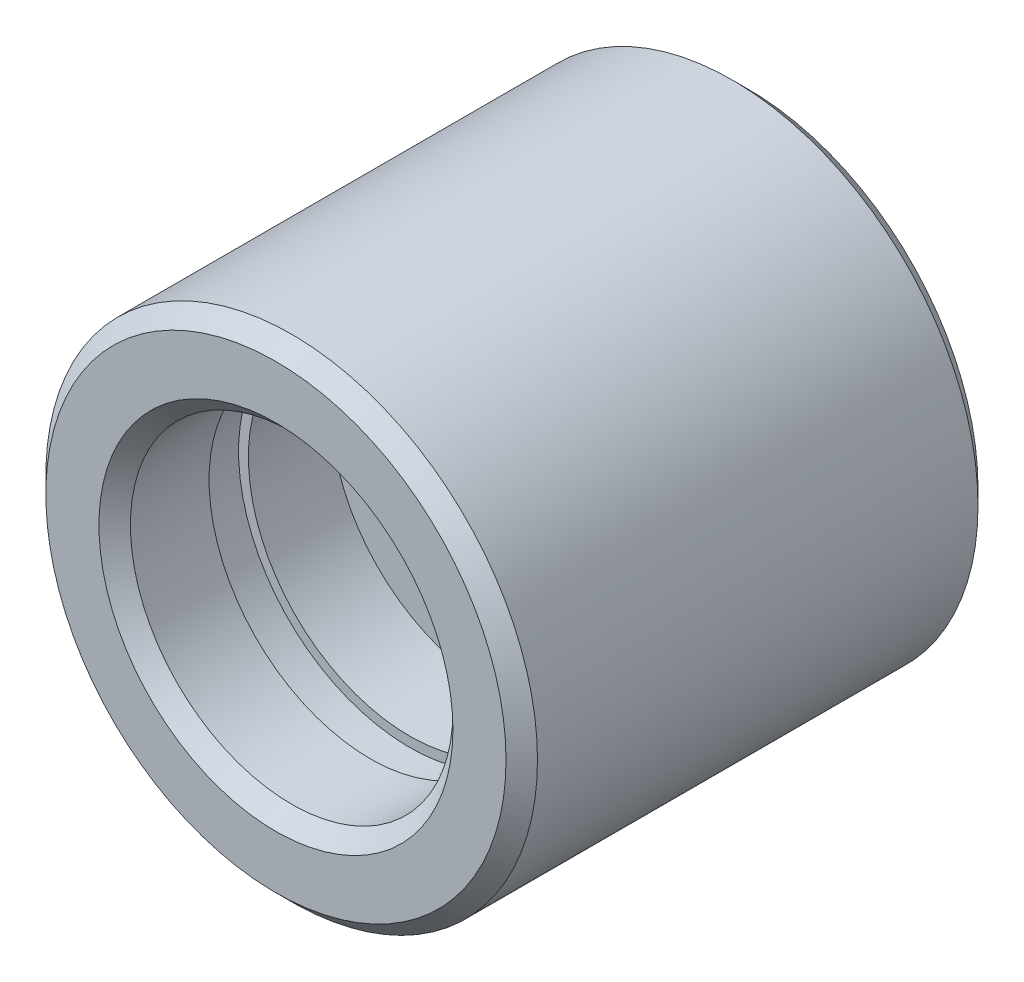
ISO-10303-21;
HEADER;
FILE_DESCRIPTION(('STEP AP214'),'2;1');
FILE_NAME('part.step','',(''),(''),'','','');
FILE_SCHEMA(('AUTOMOTIVE_DESIGN { 1 0 10303 214 1 1 1 1 }'));
ENDSEC;
DATA;
#1=APPLICATION_CONTEXT('core data for automotive mechanical design processes');
#2=APPLICATION_PROTOCOL_DEFINITION('international standard','automotive_design',2000,#1);
#3=PRODUCT_CONTEXT('',#1,'mechanical');
#4=PRODUCT('Part','Part','',(#3));
#5=PRODUCT_RELATED_PRODUCT_CATEGORY('part','',(#4));
#6=PRODUCT_DEFINITION_FORMATION('','',#4);
#7=PRODUCT_DEFINITION_CONTEXT('part definition',#1,'design');
#8=PRODUCT_DEFINITION('design','',#6,#7);
#9=PRODUCT_DEFINITION_SHAPE('','',#8);
#10=(LENGTH_UNIT() NAMED_UNIT(*) SI_UNIT(.MILLI.,.METRE.));
#11=(NAMED_UNIT(*) PLANE_ANGLE_UNIT() SI_UNIT($,.RADIAN.));
#12=(NAMED_UNIT(*) SI_UNIT($,.STERADIAN.) SOLID_ANGLE_UNIT());
#13=UNCERTAINTY_MEASURE_WITH_UNIT(LENGTH_MEASURE(1.E-05),#10,'distance_accuracy_value','');
#14=(GEOMETRIC_REPRESENTATION_CONTEXT(3) GLOBAL_UNCERTAINTY_ASSIGNED_CONTEXT((#13)) GLOBAL_UNIT_ASSIGNED_CONTEXT((#10,
#11,#12)) REPRESENTATION_CONTEXT('',''));
#15=CARTESIAN_POINT('',(0.,0.,0.));
#16=DIRECTION('',(0.,0.,1.));
#17=DIRECTION('',(1.,0.,0.));
#18=AXIS2_PLACEMENT_3D('',#15,#16,#17);
#19=CARTESIAN_POINT('',(0.,1.5,5.9));
#20=DIRECTION('',(0.,-1.,0.));
#21=DIRECTION('',(0.,0.,-1.));
#22=AXIS2_PLACEMENT_3D('',#19,#20,#21);
#23=PLANE('',#22);
#24=DIRECTION('',(-1.,0.,0.));
#25=VECTOR('',#24,1.);
#26=CARTESIAN_POINT('',(0.,1.5,5.9));
#27=LINE('',#26,#25);
#28=CARTESIAN_POINT('',(0.,1.5,5.9));
#29=VERTEX_POINT('',#28);
#30=CARTESIAN_POINT('',(-1.5,1.5,5.9));
#31=VERTEX_POINT('',#30);
#32=EDGE_CURVE('E394',#29,#31,#27,.T.);
#33=ORIENTED_EDGE('',*,*,#32,.T.);
#34=DIRECTION('',(0.,0.,1.));
#35=VECTOR('',#34,1.);
#36=CARTESIAN_POINT('',(-1.5,1.5,5.7));
#37=LINE('',#36,#35);
#38=CARTESIAN_POINT('',(-1.5,1.5,5.7));
#39=VERTEX_POINT('',#38);
#40=EDGE_CURVE('E79',#39,#31,#37,.T.);
#41=ORIENTED_EDGE('',*,*,#40,.F.);
#42=DIRECTION('',(1.,0.,0.));
#43=VECTOR('',#42,1.);
#44=CARTESIAN_POINT('',(0.,1.5,5.7));
#45=LINE('',#44,#43);
#46=CARTESIAN_POINT('',(-3.81575680566778,1.5,5.7));
#47=VERTEX_POINT('',#46);
#48=EDGE_CURVE('E161',#47,#39,#45,.T.);
#49=ORIENTED_EDGE('',*,*,#48,.F.);
#50=DIRECTION('',(0.,0.,-1.));
#51=VECTOR('',#50,1.);
#52=CARTESIAN_POINT('',(-3.81575680566778,1.5,5.9));
#53=LINE('',#52,#51);
#54=CARTESIAN_POINT('',(-3.81575680566778,1.5,5.5));
#55=VERTEX_POINT('',#54);
#56=EDGE_CURVE('E160',#47,#55,#53,.T.);
#57=ORIENTED_EDGE('',*,*,#56,.T.);
#58=DIRECTION('',(-1.,0.,0.));
#59=VECTOR('',#58,1.);
#60=CARTESIAN_POINT('',(0.,1.5,5.5));
#61=LINE('',#60,#59);
#62=CARTESIAN_POINT('',(3.81575680566778,1.5,5.5));
#63=VERTEX_POINT('',#62);
#64=EDGE_CURVE('E169',#63,#55,#61,.T.);
#65=ORIENTED_EDGE('',*,*,#64,.F.);
#66=DIRECTION('',(0.,0.,-1.));
#67=VECTOR('',#66,1.);
#68=CARTESIAN_POINT('',(3.81575680566778,1.5,5.9));
#69=LINE('',#68,#67);
#70=CARTESIAN_POINT('',(3.81575680566778,1.5,5.7));
#71=VERTEX_POINT('',#70);
#72=EDGE_CURVE('E185',#71,#63,#69,.T.);
#73=ORIENTED_EDGE('',*,*,#72,.F.);
#74=DIRECTION('',(1.,0.,0.));
#75=VECTOR('',#74,1.);
#76=CARTESIAN_POINT('',(0.,1.5,5.7));
#77=LINE('',#76,#75);
#78=CARTESIAN_POINT('',(1.5,1.5,5.7));
#79=VERTEX_POINT('',#78);
#80=EDGE_CURVE('E414',#79,#71,#77,.T.);
#81=ORIENTED_EDGE('',*,*,#80,.F.);
#82=DIRECTION('',(0.,0.,1.));
#83=VECTOR('',#82,1.);
#84=CARTESIAN_POINT('',(1.5,1.5,5.7));
#85=LINE('',#84,#83);
#86=CARTESIAN_POINT('',(1.5,1.5,5.9));
#87=VERTEX_POINT('',#86);
#88=EDGE_CURVE('E397',#79,#87,#85,.T.);
#89=ORIENTED_EDGE('',*,*,#88,.T.);
#90=DIRECTION('',(-1.,0.,0.));
#91=VECTOR('',#90,1.);
#92=CARTESIAN_POINT('',(0.,1.5,5.9));
#93=LINE('',#92,#91);
#94=EDGE_CURVE('E175',#87,#29,#93,.T.);
#95=ORIENTED_EDGE('',*,*,#94,.T.);
#96=EDGE_LOOP('',(#33,#41,#49,#57,#65,#73,#81,#89,#95));
#97=FACE_BOUND('',#96,.T.);
#98=ADVANCED_FACE('F63',(#97),#23,.T.);
#99=CARTESIAN_POINT('',(0.,-1.5,5.9));
#100=DIRECTION('',(0.,-1.,0.));
#101=DIRECTION('',(0.,0.,-1.));
#102=AXIS2_PLACEMENT_3D('',#99,#100,#101);
#103=PLANE('',#102);
#104=DIRECTION('',(0.,0.,1.));
#105=VECTOR('',#104,1.);
#106=CARTESIAN_POINT('',(-1.5,-1.5,5.7));
#107=LINE('',#106,#105);
#108=CARTESIAN_POINT('',(-1.5,-1.5,5.7));
#109=VERTEX_POINT('',#108);
#110=CARTESIAN_POINT('',(-1.5,-1.5,5.9));
#111=VERTEX_POINT('',#110);
#112=EDGE_CURVE('E421',#109,#111,#107,.T.);
#113=ORIENTED_EDGE('',*,*,#112,.T.);
#114=DIRECTION('',(-1.,0.,0.));
#115=VECTOR('',#114,1.);
#116=CARTESIAN_POINT('',(0.,-1.5,5.9));
#117=LINE('',#116,#115);
#118=CARTESIAN_POINT('',(0.,-1.5,5.9));
#119=VERTEX_POINT('',#118);
#120=EDGE_CURVE('E167',#119,#111,#117,.T.);
#121=ORIENTED_EDGE('',*,*,#120,.F.);
#122=DIRECTION('',(-1.,0.,0.));
#123=VECTOR('',#122,1.);
#124=CARTESIAN_POINT('',(0.,-1.5,5.9));
#125=LINE('',#124,#123);
#126=CARTESIAN_POINT('',(1.5,-1.5,5.9));
#127=VERTEX_POINT('',#126);
#128=EDGE_CURVE('E178',#127,#119,#125,.T.);
#129=ORIENTED_EDGE('',*,*,#128,.F.);
#130=DIRECTION('',(0.,0.,1.));
#131=VECTOR('',#130,1.);
#132=CARTESIAN_POINT('',(1.5,-1.5,5.7));
#133=LINE('',#132,#131);
#134=CARTESIAN_POINT('',(1.5,-1.5,5.7));
#135=VERTEX_POINT('',#134);
#136=EDGE_CURVE('E87',#135,#127,#133,.T.);
#137=ORIENTED_EDGE('',*,*,#136,.F.);
#138=DIRECTION('',(-1.,0.,0.));
#139=VECTOR('',#138,1.);
#140=CARTESIAN_POINT('',(0.,-1.5,5.7));
#141=LINE('',#140,#139);
#142=CARTESIAN_POINT('',(3.81575680566778,-1.5,5.7));
#143=VERTEX_POINT('',#142);
#144=EDGE_CURVE('E412',#143,#135,#141,.T.);
#145=ORIENTED_EDGE('',*,*,#144,.F.);
#146=DIRECTION('',(0.,0.,-1.));
#147=VECTOR('',#146,1.);
#148=CARTESIAN_POINT('',(3.81575680566778,-1.5,5.9));
#149=LINE('',#148,#147);
#150=CARTESIAN_POINT('',(3.81575680566778,-1.5,5.5));
#151=VERTEX_POINT('',#150);
#152=EDGE_CURVE('E189',#143,#151,#149,.T.);
#153=ORIENTED_EDGE('',*,*,#152,.T.);
#154=DIRECTION('',(-1.,0.,0.));
#155=VECTOR('',#154,1.);
#156=CARTESIAN_POINT('',(0.,-1.5,5.5));
#157=LINE('',#156,#155);
#158=CARTESIAN_POINT('',(-3.81575680566778,-1.5,5.5));
#159=VERTEX_POINT('',#158);
#160=EDGE_CURVE('E165',#151,#159,#157,.T.);
#161=ORIENTED_EDGE('',*,*,#160,.T.);
#162=DIRECTION('',(0.,0.,-1.));
#163=VECTOR('',#162,1.);
#164=CARTESIAN_POINT('',(-3.81575680566778,-1.5,5.9));
#165=LINE('',#164,#163);
#166=CARTESIAN_POINT('',(-3.81575680566778,-1.5,5.7));
#167=VERTEX_POINT('',#166);
#168=EDGE_CURVE('E157',#167,#159,#165,.T.);
#169=ORIENTED_EDGE('',*,*,#168,.F.);
#170=DIRECTION('',(-1.,0.,0.));
#171=VECTOR('',#170,1.);
#172=CARTESIAN_POINT('',(0.,-1.5,5.7));
#173=LINE('',#172,#171);
#174=EDGE_CURVE('E141',#109,#167,#173,.T.);
#175=ORIENTED_EDGE('',*,*,#174,.F.);
#176=EDGE_LOOP('',(#113,#121,#129,#137,#145,#153,#161,#169,#175));
#177=FACE_BOUND('',#176,.T.);
#178=ADVANCED_FACE('F163',(#177),#103,.F.);
#179=CARTESIAN_POINT('',(0.,0.,5.9));
#180=DIRECTION('',(0.,0.,-1.));
#181=DIRECTION('',(-1.,0.,0.));
#182=AXIS2_PLACEMENT_3D('',#179,#180,#181);
#183=PLANE('',#182);
#184=ORIENTED_EDGE('',*,*,#120,.T.);
#185=DIRECTION('',(0.,1.,0.));
#186=VECTOR('',#185,1.);
#187=CARTESIAN_POINT('',(-1.5,0.,5.9));
#188=LINE('',#187,#186);
#189=CARTESIAN_POINT('',(-1.5,0.,5.9));
#190=VERTEX_POINT('',#189);
#191=EDGE_CURVE('E228',#111,#190,#188,.T.);
#192=ORIENTED_EDGE('',*,*,#191,.T.);
#193=CARTESIAN_POINT('',(0.,0.,5.9));
#194=DIRECTION('',(0.,0.,-1.));
#195=DIRECTION('',(-1.,0.,0.));
#196=AXIS2_PLACEMENT_3D('',#193,#194,#195);
#197=CIRCLE('',#196,1.5);
#198=EDGE_CURVE('E400',#190,#119,#197,.F.);
#199=ORIENTED_EDGE('',*,*,#198,.T.);
#200=EDGE_LOOP('',(#184,#192,#199));
#201=FACE_BOUND('',#200,.T.);
#202=ADVANCED_FACE('F282',(#201),#183,.T.);
#203=EDGE_CURVE('E172',#29,#190,#197,.F.);
#204=ORIENTED_EDGE('',*,*,#203,.T.);
#205=DIRECTION('',(0.,-1.,0.));
#206=VECTOR('',#205,1.);
#207=CARTESIAN_POINT('',(-1.5,0.,5.9));
#208=LINE('',#207,#206);
#209=EDGE_CURVE('E151',#31,#190,#208,.T.);
#210=ORIENTED_EDGE('',*,*,#209,.F.);
#211=ORIENTED_EDGE('',*,*,#32,.F.);
#212=EDGE_LOOP('',(#204,#210,#211));
#213=FACE_BOUND('',#212,.T.);
#214=ADVANCED_FACE('F379',(#213),#183,.T.);
#215=CARTESIAN_POINT('',(0.,0.,5.9));
#216=DIRECTION('',(0.,0.,-1.));
#217=DIRECTION('',(-1.,0.,0.));
#218=AXIS2_PLACEMENT_3D('',#215,#216,#217);
#219=PLANE('',#218);
#220=ORIENTED_EDGE('',*,*,#94,.F.);
#221=DIRECTION('',(0.,-1.,0.));
#222=VECTOR('',#221,1.);
#223=CARTESIAN_POINT('',(1.5,0.,5.9));
#224=LINE('',#223,#222);
#225=CARTESIAN_POINT('',(1.5,0.,5.9));
#226=VERTEX_POINT('',#225);
#227=EDGE_CURVE('E225',#87,#226,#224,.T.);
#228=ORIENTED_EDGE('',*,*,#227,.T.);
#229=CARTESIAN_POINT('',(0.,0.,5.9));
#230=DIRECTION('',(0.,0.,-1.));
#231=DIRECTION('',(-1.,0.,0.));
#232=AXIS2_PLACEMENT_3D('',#229,#230,#231);
#233=CIRCLE('',#232,1.5);
#234=EDGE_CURVE('E181',#226,#29,#233,.F.);
#235=ORIENTED_EDGE('',*,*,#234,.T.);
#236=EDGE_LOOP('',(#220,#228,#235));
#237=FACE_BOUND('',#236,.T.);
#238=ADVANCED_FACE('F381',(#237),#219,.T.);
#239=EDGE_CURVE('E182',#119,#226,#233,.F.);
#240=ORIENTED_EDGE('',*,*,#239,.T.);
#241=DIRECTION('',(0.,1.,0.));
#242=VECTOR('',#241,1.);
#243=CARTESIAN_POINT('',(1.5,0.,5.9));
#244=LINE('',#243,#242);
#245=EDGE_CURVE('E410',#127,#226,#244,.T.);
#246=ORIENTED_EDGE('',*,*,#245,.F.);
#247=ORIENTED_EDGE('',*,*,#128,.T.);
#248=EDGE_LOOP('',(#240,#246,#247));
#249=FACE_BOUND('',#248,.T.);
#250=ADVANCED_FACE('F327',(#249),#219,.T.);
#251=CARTESIAN_POINT('',(0.,0.,-0.000999999999999265));
#252=DIRECTION('',(0.,0.,1.));
#253=DIRECTION('',(1.,0.,0.));
#254=AXIS2_PLACEMENT_3D('',#251,#252,#253);
#255=CYLINDRICAL_SURFACE('',#254,1.5);
#256=CARTESIAN_POINT('',(0.,0.,6.5));
#257=DIRECTION('',(0.,0.,1.));
#258=DIRECTION('',(1.,0.,0.));
#259=AXIS2_PLACEMENT_3D('',#256,#257,#258);
#260=CIRCLE('',#259,1.5);
#261=CARTESIAN_POINT('',(1.5,0.,6.5));
#262=VERTEX_POINT('',#261);
#263=EDGE_CURVE('E222',#262,#262,#260,.F.);
#264=ORIENTED_EDGE('',*,*,#263,.F.);
#265=EDGE_LOOP('',(#264));
#266=FACE_BOUND('',#265,.T.);
#267=ORIENTED_EDGE('',*,*,#203,.F.);
#268=ORIENTED_EDGE('',*,*,#234,.F.);
#269=ORIENTED_EDGE('',*,*,#239,.F.);
#270=ORIENTED_EDGE('',*,*,#198,.F.);
#271=EDGE_LOOP('',(#267,#268,#269,#270));
#272=FACE_BOUND('',#271,.T.);
#273=ADVANCED_FACE('F324',(#266,#272),#255,.F.);
#274=CARTESIAN_POINT('',(0.,0.,5.5));
#275=DIRECTION('',(0.,0.,-1.));
#276=DIRECTION('',(-1.,0.,0.));
#277=AXIS2_PLACEMENT_3D('',#274,#275,#276);
#278=PLANE('',#277);
#279=ORIENTED_EDGE('',*,*,#64,.T.);
#280=CARTESIAN_POINT('',(0.,0.,5.5));
#281=DIRECTION('',(0.,0.,-1.));
#282=DIRECTION('',(-1.,0.,0.));
#283=AXIS2_PLACEMENT_3D('',#280,#281,#282);
#284=CIRCLE('',#283,4.1);
#285=EDGE_CURVE('E206',#55,#63,#284,.T.);
#286=ORIENTED_EDGE('',*,*,#285,.T.);
#287=EDGE_LOOP('',(#279,#286));
#288=FACE_BOUND('',#287,.T.);
#289=ADVANCED_FACE('F315',(#288),#278,.T.);
#290=EDGE_CURVE('E217',#151,#159,#284,.T.);
#291=ORIENTED_EDGE('',*,*,#290,.T.);
#292=ORIENTED_EDGE('',*,*,#160,.F.);
#293=EDGE_LOOP('',(#291,#292));
#294=FACE_BOUND('',#293,.T.);
#295=ADVANCED_FACE('F312',(#294),#278,.T.);
#296=CARTESIAN_POINT('',(0.,0.,6.5));
#297=DIRECTION('',(0.,0.,1.));
#298=DIRECTION('',(1.,0.,0.));
#299=AXIS2_PLACEMENT_3D('',#296,#297,#298);
#300=CYLINDRICAL_SURFACE('',#299,4.1);
#301=CARTESIAN_POINT('',(0.,0.,8.6));
#302=DIRECTION('',(0.,0.,1.));
#303=DIRECTION('',(1.,0.,0.));
#304=AXIS2_PLACEMENT_3D('',#301,#302,#303);
#305=CIRCLE('',#304,4.1);
#306=CARTESIAN_POINT('',(4.1,0.,8.6));
#307=VERTEX_POINT('',#306);
#308=EDGE_CURVE('E197',#307,#307,#305,.T.);
#309=ORIENTED_EDGE('',*,*,#308,.T.);
#310=EDGE_LOOP('',(#309));
#311=FACE_BOUND('',#310,.T.);
#312=CARTESIAN_POINT('',(0.,0.,6.5));
#313=DIRECTION('',(0.,0.,1.));
#314=DIRECTION('',(1.,0.,0.));
#315=AXIS2_PLACEMENT_3D('',#312,#313,#314);
#316=CIRCLE('',#315,4.1);
#317=CARTESIAN_POINT('',(4.1,0.,6.5));
#318=VERTEX_POINT('',#317);
#319=EDGE_CURVE('E219',#318,#318,#316,.T.);
#320=ORIENTED_EDGE('',*,*,#319,.F.);
#321=EDGE_LOOP('',(#320));
#322=FACE_BOUND('',#321,.T.);
#323=ADVANCED_FACE('F274',(#311,#322),#300,.F.);
#324=CARTESIAN_POINT('',(0.,0.,5.5));
#325=DIRECTION('',(0.,0.,-1.));
#326=DIRECTION('',(-1.,0.,0.));
#327=AXIS2_PLACEMENT_3D('',#324,#325,#326);
#328=CYLINDRICAL_SURFACE('',#327,4.1);
#329=CARTESIAN_POINT('',(0.,0.,3.4));
#330=DIRECTION('',(0.,0.,1.));
#331=DIRECTION('',(1.,0.,0.));
#332=AXIS2_PLACEMENT_3D('',#329,#330,#331);
#333=CIRCLE('',#332,4.1);
#334=CARTESIAN_POINT('',(4.1,0.,3.4));
#335=VERTEX_POINT('',#334);
#336=EDGE_CURVE('E203',#335,#335,#333,.T.);
#337=ORIENTED_EDGE('',*,*,#336,.F.);
#338=EDGE_LOOP('',(#337));
#339=FACE_BOUND('',#338,.T.);
#340=ORIENTED_EDGE('',*,*,#56,.F.);
#341=CARTESIAN_POINT('',(0.,0.,5.7));
#342=DIRECTION('',(0.,0.,-1.));
#343=DIRECTION('',(-1.,0.,0.));
#344=AXIS2_PLACEMENT_3D('',#341,#342,#343);
#345=CIRCLE('',#344,4.1);
#346=EDGE_CURVE('E144',#167,#47,#345,.T.);
#347=ORIENTED_EDGE('',*,*,#346,.F.);
#348=ORIENTED_EDGE('',*,*,#168,.T.);
#349=ORIENTED_EDGE('',*,*,#290,.F.);
#350=ORIENTED_EDGE('',*,*,#152,.F.);
#351=CARTESIAN_POINT('',(0.,0.,5.7));
#352=DIRECTION('',(0.,0.,-1.));
#353=DIRECTION('',(-1.,0.,0.));
#354=AXIS2_PLACEMENT_3D('',#351,#352,#353);
#355=CIRCLE('',#354,4.1);
#356=EDGE_CURVE('E409',#71,#143,#355,.T.);
#357=ORIENTED_EDGE('',*,*,#356,.F.);
#358=ORIENTED_EDGE('',*,*,#72,.T.);
#359=ORIENTED_EDGE('',*,*,#285,.F.);
#360=EDGE_LOOP('',(#340,#347,#348,#349,#350,#357,#358,#359));
#361=FACE_BOUND('',#360,.T.);
#362=ADVANCED_FACE('F155',(#339,#361),#328,.F.);
#363=CARTESIAN_POINT('',(0.,0.,6.5));
#364=DIRECTION('',(0.,0.,1.));
#365=DIRECTION('',(1.,0.,0.));
#366=AXIS2_PLACEMENT_3D('',#363,#364,#365);
#367=PLANE('',#366);
#368=ORIENTED_EDGE('',*,*,#319,.T.);
#369=EDGE_LOOP('',(#368));
#370=FACE_BOUND('',#369,.T.);
#371=ORIENTED_EDGE('',*,*,#263,.T.);
#372=EDGE_LOOP('',(#371));
#373=FACE_BOUND('',#372,.T.);
#374=ADVANCED_FACE('F299',(#370,#373),#367,.T.);
#375=CARTESIAN_POINT('',(4.1,0.,3.4));
#376=DIRECTION('',(0.,0.,1.));
#377=DIRECTION('',(1.,0.,0.));
#378=AXIS2_PLACEMENT_3D('',#375,#376,#377);
#379=PLANE('',#378);
#380=CARTESIAN_POINT('',(0.,0.,3.4));
#381=DIRECTION('',(0.,0.,1.));
#382=DIRECTION('',(1.,0.,0.));
#383=AXIS2_PLACEMENT_3D('',#380,#381,#382);
#384=CIRCLE('',#383,4.35);
#385=CARTESIAN_POINT('',(4.35,0.,3.4));
#386=VERTEX_POINT('',#385);
#387=EDGE_CURVE('E200',#386,#386,#384,.T.);
#388=ORIENTED_EDGE('',*,*,#387,.F.);
#389=EDGE_LOOP('',(#388));
#390=FACE_BOUND('',#389,.T.);
#391=ORIENTED_EDGE('',*,*,#336,.T.);
#392=EDGE_LOOP('',(#391));
#393=FACE_BOUND('',#392,.T.);
#394=ADVANCED_FACE('F295',(#390,#393),#379,.F.);
#395=CARTESIAN_POINT('',(0.,0.,12.));
#396=DIRECTION('',(0.,0.,1.));
#397=DIRECTION('',(1.,0.,0.));
#398=AXIS2_PLACEMENT_3D('',#395,#396,#397);
#399=CYLINDRICAL_SURFACE('',#398,4.35);
#400=CARTESIAN_POINT('',(0.,0.,2.4));
#401=DIRECTION('',(0.,0.,1.));
#402=DIRECTION('',(1.,0.,0.));
#403=AXIS2_PLACEMENT_3D('',#400,#401,#402);
#404=CIRCLE('',#403,4.35);
#405=CARTESIAN_POINT('',(4.35,0.,2.4));
#406=VERTEX_POINT('',#405);
#407=EDGE_CURVE('E196',#406,#406,#404,.T.);
#408=ORIENTED_EDGE('',*,*,#407,.F.);
#409=EDGE_LOOP('',(#408));
#410=FACE_BOUND('',#409,.T.);
#411=ORIENTED_EDGE('',*,*,#387,.T.);
#412=EDGE_LOOP('',(#411));
#413=FACE_BOUND('',#412,.T.);
#414=ADVANCED_FACE('F291',(#410,#413),#399,.F.);
#415=CARTESIAN_POINT('',(4.1,0.,2.4));
#416=DIRECTION('',(0.,0.,-1.));
#417=DIRECTION('',(-1.,0.,0.));
#418=AXIS2_PLACEMENT_3D('',#415,#416,#417);
#419=PLANE('',#418);
#420=CARTESIAN_POINT('',(0.,0.,2.4));
#421=DIRECTION('',(0.,0.,1.));
#422=DIRECTION('',(1.,0.,0.));
#423=AXIS2_PLACEMENT_3D('',#420,#421,#422);
#424=CIRCLE('',#423,4.1);
#425=CARTESIAN_POINT('',(4.1,0.,2.4));
#426=VERTEX_POINT('',#425);
#427=EDGE_CURVE('E193',#426,#426,#424,.T.);
#428=ORIENTED_EDGE('',*,*,#427,.F.);
#429=EDGE_LOOP('',(#428));
#430=FACE_BOUND('',#429,.T.);
#431=ORIENTED_EDGE('',*,*,#407,.T.);
#432=EDGE_LOOP('',(#431));
#433=FACE_BOUND('',#432,.T.);
#434=ADVANCED_FACE('F287',(#430,#433),#419,.F.);
#435=CARTESIAN_POINT('',(4.1,0.,8.6));
#436=DIRECTION('',(0.,0.,-1.));
#437=DIRECTION('',(-1.,0.,0.));
#438=AXIS2_PLACEMENT_3D('',#435,#436,#437);
#439=PLANE('',#438);
#440=ORIENTED_EDGE('',*,*,#308,.F.);
#441=EDGE_LOOP('',(#440));
#442=FACE_BOUND('',#441,.T.);
#443=CARTESIAN_POINT('',(0.,0.,8.6));
#444=DIRECTION('',(0.,0.,1.));
#445=DIRECTION('',(1.,0.,0.));
#446=AXIS2_PLACEMENT_3D('',#443,#444,#445);
#447=CIRCLE('',#446,4.35);
#448=CARTESIAN_POINT('',(4.35,0.,8.6));
#449=VERTEX_POINT('',#448);
#450=EDGE_CURVE('E212',#449,#449,#447,.T.);
#451=ORIENTED_EDGE('',*,*,#450,.T.);
#452=EDGE_LOOP('',(#451));
#453=FACE_BOUND('',#452,.T.);
#454=ADVANCED_FACE('F290',(#442,#453),#439,.F.);
#455=CARTESIAN_POINT('',(0.,0.,12.));
#456=DIRECTION('',(0.,0.,1.));
#457=DIRECTION('',(1.,0.,0.));
#458=AXIS2_PLACEMENT_3D('',#455,#456,#457);
#459=CYLINDRICAL_SURFACE('',#458,4.35);
#460=ORIENTED_EDGE('',*,*,#450,.F.);
#461=EDGE_LOOP('',(#460));
#462=FACE_BOUND('',#461,.T.);
#463=CARTESIAN_POINT('',(0.,0.,9.6));
#464=DIRECTION('',(0.,0.,1.));
#465=DIRECTION('',(1.,0.,0.));
#466=AXIS2_PLACEMENT_3D('',#463,#464,#465);
#467=CIRCLE('',#466,4.35);
#468=CARTESIAN_POINT('',(4.35,0.,9.6));
#469=VERTEX_POINT('',#468);
#470=EDGE_CURVE('E209',#469,#469,#467,.T.);
#471=ORIENTED_EDGE('',*,*,#470,.T.);
#472=EDGE_LOOP('',(#471));
#473=FACE_BOUND('',#472,.T.);
#474=ADVANCED_FACE('F304',(#462,#473),#459,.F.);
#475=CARTESIAN_POINT('',(4.1,0.,9.6));
#476=DIRECTION('',(0.,0.,1.));
#477=DIRECTION('',(1.,0.,0.));
#478=AXIS2_PLACEMENT_3D('',#475,#476,#477);
#479=PLANE('',#478);
#480=ORIENTED_EDGE('',*,*,#470,.F.);
#481=EDGE_LOOP('',(#480));
#482=FACE_BOUND('',#481,.T.);
#483=CARTESIAN_POINT('',(0.,0.,9.6));
#484=DIRECTION('',(0.,0.,1.));
#485=DIRECTION('',(1.,0.,0.));
#486=AXIS2_PLACEMENT_3D('',#483,#484,#485);
#487=CIRCLE('',#486,4.1);
#488=CARTESIAN_POINT('',(4.1,0.,9.6));
#489=VERTEX_POINT('',#488);
#490=EDGE_CURVE('E191',#489,#489,#487,.T.);
#491=ORIENTED_EDGE('',*,*,#490,.T.);
#492=EDGE_LOOP('',(#491));
#493=FACE_BOUND('',#492,.T.);
#494=ADVANCED_FACE('F301',(#482,#493),#479,.F.);
#495=CARTESIAN_POINT('',(0.,0.,12.));
#496=DIRECTION('',(0.,0.,1.));
#497=DIRECTION('',(1.,0.,0.));
#498=AXIS2_PLACEMENT_3D('',#495,#496,#497);
#499=PLANE('',#498);
#500=CARTESIAN_POINT('',(0.,0.,12.));
#501=DIRECTION('',(0.,0.,1.));
#502=DIRECTION('',(1.,0.,0.));
#503=AXIS2_PLACEMENT_3D('',#500,#501,#502);
#504=CIRCLE('',#503,5.85);
#505=CARTESIAN_POINT('',(5.85,0.,12.));
#506=VERTEX_POINT('',#505);
#507=EDGE_CURVE('E234',#506,#506,#504,.T.);
#508=ORIENTED_EDGE('',*,*,#507,.T.);
#509=EDGE_LOOP('',(#508));
#510=FACE_BOUND('',#509,.T.);
#511=CARTESIAN_POINT('',(0.,0.,12.));
#512=DIRECTION('',(0.,0.,1.));
#513=DIRECTION('',(1.,0.,0.));
#514=AXIS2_PLACEMENT_3D('',#511,#512,#513);
#515=CIRCLE('',#514,4.5);
#516=CARTESIAN_POINT('',(4.5,0.,12.));
#517=VERTEX_POINT('',#516);
#518=EDGE_CURVE('E231',#517,#517,#515,.F.);
#519=ORIENTED_EDGE('',*,*,#518,.T.);
#520=EDGE_LOOP('',(#519));
#521=FACE_BOUND('',#520,.T.);
#522=ADVANCED_FACE('F271',(#510,#521),#499,.T.);
#523=CARTESIAN_POINT('',(0.,0.,11.6));
#524=DIRECTION('',(0.,0.,1.));
#525=DIRECTION('',(1.,0.,0.));
#526=AXIS2_PLACEMENT_3D('',#523,#524,#525);
#527=CIRCLE('',#526,4.1);
#528=CARTESIAN_POINT('',(4.1,0.,11.6));
#529=VERTEX_POINT('',#528);
#530=EDGE_CURVE('E243',#529,#529,#527,.T.);
#531=ORIENTED_EDGE('',*,*,#530,.T.);
#532=EDGE_LOOP('',(#531));
#533=FACE_BOUND('',#532,.T.);
#534=ORIENTED_EDGE('',*,*,#490,.F.);
#535=EDGE_LOOP('',(#534));
#536=FACE_BOUND('',#535,.T.);
#537=ADVANCED_FACE('F262',(#533,#536),#300,.F.);
#538=CARTESIAN_POINT('',(0.,0.,12.));
#539=DIRECTION('',(0.,0.,-1.));
#540=DIRECTION('',(-1.,0.,0.));
#541=AXIS2_PLACEMENT_3D('',#538,#539,#540);
#542=CYLINDRICAL_SURFACE('',#541,6.25);
#543=CARTESIAN_POINT('',(0.,0.,11.6));
#544=DIRECTION('',(0.,0.,1.));
#545=DIRECTION('',(1.,0.,0.));
#546=AXIS2_PLACEMENT_3D('',#543,#544,#545);
#547=CIRCLE('',#546,6.25);
#548=CARTESIAN_POINT('',(6.25,0.,11.6));
#549=VERTEX_POINT('',#548);
#550=EDGE_CURVE('E240',#549,#549,#547,.F.);
#551=ORIENTED_EDGE('',*,*,#550,.T.);
#552=EDGE_LOOP('',(#551));
#553=FACE_BOUND('',#552,.T.);
#554=CARTESIAN_POINT('',(0.,0.,0.400000000000001));
#555=DIRECTION('',(0.,0.,1.));
#556=DIRECTION('',(1.,0.,0.));
#557=AXIS2_PLACEMENT_3D('',#554,#555,#556);
#558=CIRCLE('',#557,6.25);
#559=CARTESIAN_POINT('',(6.25,0.,0.400000000000001));
#560=VERTEX_POINT('',#559);
#561=EDGE_CURVE('E237',#560,#560,#558,.T.);
#562=ORIENTED_EDGE('',*,*,#561,.T.);
#563=EDGE_LOOP('',(#562));
#564=FACE_BOUND('',#563,.T.);
#565=ADVANCED_FACE('F260',(#553,#564),#542,.T.);
#566=CARTESIAN_POINT('',(0.,0.,0.));
#567=DIRECTION('',(0.,0.,1.));
#568=DIRECTION('',(1.,0.,0.));
#569=AXIS2_PLACEMENT_3D('',#566,#567,#568);
#570=PLANE('',#569);
#571=CARTESIAN_POINT('',(0.,0.,0.));
#572=DIRECTION('',(0.,0.,1.));
#573=DIRECTION('',(1.,0.,0.));
#574=AXIS2_PLACEMENT_3D('',#571,#572,#573);
#575=CIRCLE('',#574,5.85);
#576=CARTESIAN_POINT('',(5.85,0.,0.));
#577=VERTEX_POINT('',#576);
#578=EDGE_CURVE('E72',#577,#577,#575,.F.);
#579=ORIENTED_EDGE('',*,*,#578,.T.);
#580=EDGE_LOOP('',(#579));
#581=FACE_BOUND('',#580,.T.);
#582=CARTESIAN_POINT('',(0.,0.,0.));
#583=DIRECTION('',(0.,0.,1.));
#584=DIRECTION('',(1.,0.,0.));
#585=AXIS2_PLACEMENT_3D('',#582,#583,#584);
#586=CIRCLE('',#585,4.5);
#587=CARTESIAN_POINT('',(4.5,0.,0.));
#588=VERTEX_POINT('',#587);
#589=EDGE_CURVE('E246',#588,#588,#586,.T.);
#590=ORIENTED_EDGE('',*,*,#589,.T.);
#591=EDGE_LOOP('',(#590));
#592=FACE_BOUND('',#591,.T.);
#593=ADVANCED_FACE('F251',(#581,#592),#570,.F.);
#594=CARTESIAN_POINT('',(0.,0.,0.400000000000001));
#595=DIRECTION('',(0.,0.,1.));
#596=DIRECTION('',(1.,0.,0.));
#597=AXIS2_PLACEMENT_3D('',#594,#595,#596);
#598=CIRCLE('',#597,4.1);
#599=CARTESIAN_POINT('',(4.1,0.,0.400000000000001));
#600=VERTEX_POINT('',#599);
#601=EDGE_CURVE('E12',#600,#600,#598,.F.);
#602=ORIENTED_EDGE('',*,*,#601,.T.);
#603=EDGE_LOOP('',(#602));
#604=FACE_BOUND('',#603,.T.);
#605=ORIENTED_EDGE('',*,*,#427,.T.);
#606=EDGE_LOOP('',(#605));
#607=FACE_BOUND('',#606,.T.);
#608=ADVANCED_FACE('F269',(#604,#607),#328,.F.);
#609=CARTESIAN_POINT('',(1.5,0.,5.7));
#610=DIRECTION('',(1.,0.,0.));
#611=DIRECTION('',(0.,1.,0.));
#612=AXIS2_PLACEMENT_3D('',#609,#610,#611);
#613=PLANE('',#612);
#614=ORIENTED_EDGE('',*,*,#245,.T.);
#615=ORIENTED_EDGE('',*,*,#227,.F.);
#616=ORIENTED_EDGE('',*,*,#88,.F.);
#617=DIRECTION('',(0.,1.,0.));
#618=VECTOR('',#617,1.);
#619=CARTESIAN_POINT('',(1.5,0.,5.7));
#620=LINE('',#619,#618);
#621=EDGE_CURVE('E416',#135,#79,#620,.T.);
#622=ORIENTED_EDGE('',*,*,#621,.F.);
#623=ORIENTED_EDGE('',*,*,#136,.T.);
#624=EDGE_LOOP('',(#614,#615,#616,#622,#623));
#625=FACE_BOUND('',#624,.T.);
#626=ADVANCED_FACE('F319',(#625),#613,.F.);
#627=CARTESIAN_POINT('',(0.,0.,5.7));
#628=DIRECTION('',(0.,0.,-1.));
#629=DIRECTION('',(-1.,0.,0.));
#630=AXIS2_PLACEMENT_3D('',#627,#628,#629);
#631=PLANE('',#630);
#632=ORIENTED_EDGE('',*,*,#144,.T.);
#633=ORIENTED_EDGE('',*,*,#621,.T.);
#634=ORIENTED_EDGE('',*,*,#80,.T.);
#635=ORIENTED_EDGE('',*,*,#356,.T.);
#636=EDGE_LOOP('',(#632,#633,#634,#635));
#637=FACE_BOUND('',#636,.T.);
#638=ADVANCED_FACE('F370',(#637),#631,.T.);
#639=CARTESIAN_POINT('',(-1.5,0.,5.7));
#640=DIRECTION('',(-1.,0.,0.));
#641=DIRECTION('',(0.,-1.,0.));
#642=AXIS2_PLACEMENT_3D('',#639,#640,#641);
#643=PLANE('',#642);
#644=ORIENTED_EDGE('',*,*,#209,.T.);
#645=ORIENTED_EDGE('',*,*,#191,.F.);
#646=ORIENTED_EDGE('',*,*,#112,.F.);
#647=DIRECTION('',(0.,-1.,0.));
#648=VECTOR('',#647,1.);
#649=CARTESIAN_POINT('',(-1.5,0.,5.7));
#650=LINE('',#649,#648);
#651=EDGE_CURVE('E146',#39,#109,#650,.T.);
#652=ORIENTED_EDGE('',*,*,#651,.F.);
#653=ORIENTED_EDGE('',*,*,#40,.T.);
#654=EDGE_LOOP('',(#644,#645,#646,#652,#653));
#655=FACE_BOUND('',#654,.T.);
#656=ADVANCED_FACE('F363',(#655),#643,.F.);
#657=CARTESIAN_POINT('',(0.,0.,5.7));
#658=DIRECTION('',(0.,0.,-1.));
#659=DIRECTION('',(-1.,0.,0.));
#660=AXIS2_PLACEMENT_3D('',#657,#658,#659);
#661=PLANE('',#660);
#662=ORIENTED_EDGE('',*,*,#174,.T.);
#663=ORIENTED_EDGE('',*,*,#346,.T.);
#664=ORIENTED_EDGE('',*,*,#48,.T.);
#665=ORIENTED_EDGE('',*,*,#651,.T.);
#666=EDGE_LOOP('',(#662,#663,#664,#665));
#667=FACE_BOUND('',#666,.T.);
#668=ADVANCED_FACE('F143',(#667),#661,.T.);
#669=CARTESIAN_POINT('',(0.,0.,12.));
#670=DIRECTION('',(0.,0.,-1.));
#671=DIRECTION('',(-1.,0.,0.));
#672=AXIS2_PLACEMENT_3D('',#669,#670,#671);
#673=CONICAL_SURFACE('',#672,5.85,0.785398163397445);
#674=ORIENTED_EDGE('',*,*,#550,.F.);
#675=EDGE_LOOP('',(#674));
#676=FACE_BOUND('',#675,.T.);
#677=ORIENTED_EDGE('',*,*,#507,.F.);
#678=EDGE_LOOP('',(#677));
#679=FACE_BOUND('',#678,.T.);
#680=ADVANCED_FACE('F339',(#676,#679),#673,.T.);
#681=CARTESIAN_POINT('',(0.,0.,11.6));
#682=DIRECTION('',(0.,0.,1.));
#683=DIRECTION('',(1.,0.,0.));
#684=AXIS2_PLACEMENT_3D('',#681,#682,#683);
#685=CONICAL_SURFACE('',#684,4.1,0.785398163397453);
#686=ORIENTED_EDGE('',*,*,#518,.F.);
#687=EDGE_LOOP('',(#686));
#688=FACE_BOUND('',#687,.T.);
#689=ORIENTED_EDGE('',*,*,#530,.F.);
#690=EDGE_LOOP('',(#689));
#691=FACE_BOUND('',#690,.T.);
#692=ADVANCED_FACE('F257',(#688,#691),#685,.F.);
#693=CARTESIAN_POINT('',(0.,0.,0.400000000000001));
#694=DIRECTION('',(0.,0.,1.));
#695=DIRECTION('',(1.,0.,0.));
#696=AXIS2_PLACEMENT_3D('',#693,#694,#695);
#697=CONICAL_SURFACE('',#696,6.25,0.785398163397453);
#698=ORIENTED_EDGE('',*,*,#578,.F.);
#699=EDGE_LOOP('',(#698));
#700=FACE_BOUND('',#699,.T.);
#701=ORIENTED_EDGE('',*,*,#561,.F.);
#702=EDGE_LOOP('',(#701));
#703=FACE_BOUND('',#702,.T.);
#704=ADVANCED_FACE('F254',(#700,#703),#697,.T.);
#705=CARTESIAN_POINT('',(0.,0.,0.400000000000001));
#706=DIRECTION('',(0.,0.,-1.));
#707=DIRECTION('',(-1.,0.,0.));
#708=AXIS2_PLACEMENT_3D('',#705,#706,#707);
#709=CONICAL_SURFACE('',#708,4.1,0.785398163397448);
#710=ORIENTED_EDGE('',*,*,#589,.F.);
#711=EDGE_LOOP('',(#710));
#712=FACE_BOUND('',#711,.T.);
#713=ORIENTED_EDGE('',*,*,#601,.F.);
#714=EDGE_LOOP('',(#713));
#715=FACE_BOUND('',#714,.T.);
#716=ADVANCED_FACE('F66',(#712,#715),#709,.F.);
#717=CLOSED_SHELL('',(#98,#178,#202,#214,#238,#250,#273,#289,#295,#323,#362,#374,#394,#414,#434,
#454,#474,#494,#522,#537,#565,#593,#608,#626,#638,#656,#668,#680,#692,#704,#716));
#718=MANIFOLD_SOLID_BREP('B2',#717);
#719=ADVANCED_BREP_SHAPE_REPRESENTATION('',(#18,#718),#14);
#720=SHAPE_DEFINITION_REPRESENTATION(#9,#719);
ENDSEC;
END-ISO-10303-21;
